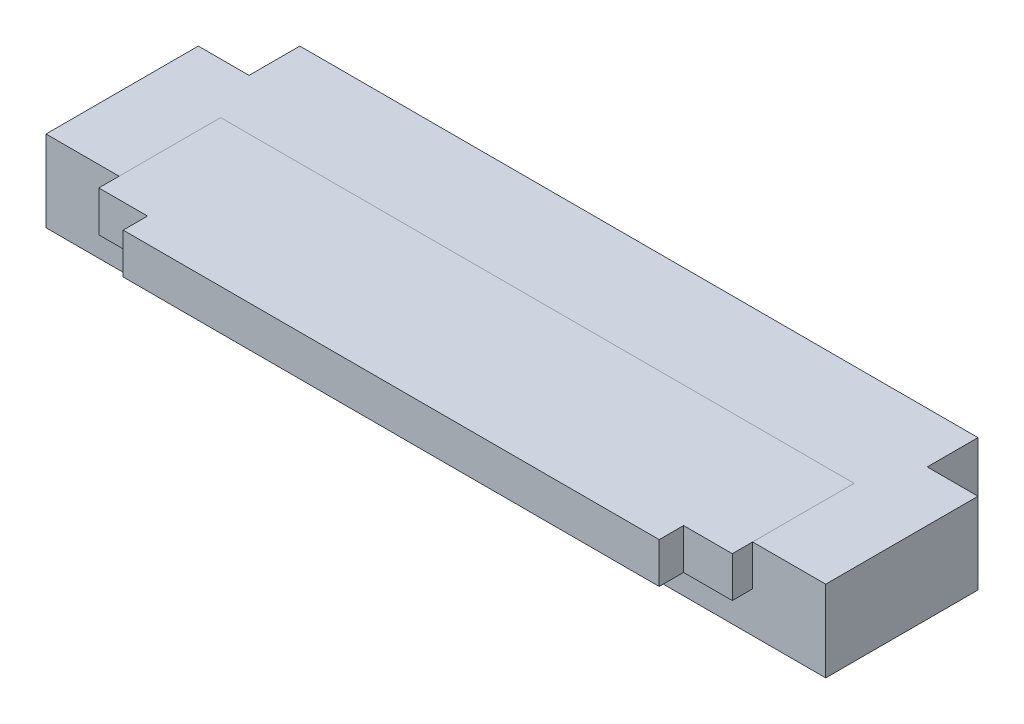
ISO-10303-21;
HEADER;
FILE_DESCRIPTION(('STEP AP214'),'2;1');
FILE_NAME('part.step','',(''),(''),'','','');
FILE_SCHEMA(('AUTOMOTIVE_DESIGN { 1 0 10303 214 1 1 1 1 }'));
ENDSEC;
DATA;
#1=APPLICATION_CONTEXT('core data for automotive mechanical design processes');
#2=APPLICATION_PROTOCOL_DEFINITION('international standard','automotive_design',2000,#1);
#3=PRODUCT_CONTEXT('',#1,'mechanical');
#4=PRODUCT('Part','Part','',(#3));
#5=PRODUCT_RELATED_PRODUCT_CATEGORY('part','',(#4));
#6=PRODUCT_DEFINITION_FORMATION('','',#4);
#7=PRODUCT_DEFINITION_CONTEXT('part definition',#1,'design');
#8=PRODUCT_DEFINITION('design','',#6,#7);
#9=PRODUCT_DEFINITION_SHAPE('','',#8);
#10=(LENGTH_UNIT() NAMED_UNIT(*) SI_UNIT(.MILLI.,.METRE.));
#11=(NAMED_UNIT(*) PLANE_ANGLE_UNIT() SI_UNIT($,.RADIAN.));
#12=(NAMED_UNIT(*) SI_UNIT($,.STERADIAN.) SOLID_ANGLE_UNIT());
#13=UNCERTAINTY_MEASURE_WITH_UNIT(LENGTH_MEASURE(1.E-05),#10,'distance_accuracy_value','');
#14=(GEOMETRIC_REPRESENTATION_CONTEXT(3) GLOBAL_UNCERTAINTY_ASSIGNED_CONTEXT((#13)) GLOBAL_UNIT_ASSIGNED_CONTEXT((#10,
#11,#12)) REPRESENTATION_CONTEXT('',''));
#15=CARTESIAN_POINT('',(0.,0.,0.));
#16=DIRECTION('',(0.,0.,1.));
#17=DIRECTION('',(1.,0.,0.));
#18=AXIS2_PLACEMENT_3D('',#15,#16,#17);
#19=CARTESIAN_POINT('',(-3.9,1.,1.5));
#20=DIRECTION('',(0.,1.,0.));
#21=DIRECTION('',(0.,0.,1.));
#22=AXIS2_PLACEMENT_3D('',#19,#20,#21);
#23=PLANE('',#22);
#24=DIRECTION('',(0.,0.,-1.));
#25=VECTOR('',#24,1.);
#26=CARTESIAN_POINT('',(3.9,1.,0.));
#27=LINE('',#26,#25);
#28=CARTESIAN_POINT('',(3.9,1.,0.));
#29=VERTEX_POINT('',#28);
#30=CARTESIAN_POINT('',(3.9,1.,1.5));
#31=VERTEX_POINT('',#30);
#32=EDGE_CURVE('P0_E115',#29,#31,#27,.F.);
#33=ORIENTED_EDGE('',*,*,#32,.F.);
#34=DIRECTION('',(-1.,0.,0.));
#35=VECTOR('',#34,1.);
#36=CARTESIAN_POINT('',(-3.9,1.,0.));
#37=LINE('',#36,#35);
#38=CARTESIAN_POINT('',(-3.9,1.,0.));
#39=VERTEX_POINT('',#38);
#40=EDGE_CURVE('P0_E119',#39,#29,#37,.F.);
#41=ORIENTED_EDGE('',*,*,#40,.F.);
#42=DIRECTION('',(0.,0.,1.));
#43=VECTOR('',#42,1.);
#44=CARTESIAN_POINT('',(-3.9,1.,1.5));
#45=LINE('',#44,#43);
#46=CARTESIAN_POINT('',(-3.9,1.,1.5));
#47=VERTEX_POINT('',#46);
#48=EDGE_CURVE('P0_E20',#39,#47,#45,.T.);
#49=ORIENTED_EDGE('',*,*,#48,.T.);
#50=DIRECTION('',(1.,0.,0.));
#51=VECTOR('',#50,1.);
#52=CARTESIAN_POINT('',(-3.9,1.,1.5));
#53=LINE('',#52,#51);
#54=CARTESIAN_POINT('',(-3.3,1.,1.5));
#55=VERTEX_POINT('',#54);
#56=EDGE_CURVE('P0_E92',#55,#47,#53,.F.);
#57=ORIENTED_EDGE('',*,*,#56,.F.);
#58=DIRECTION('',(0.,0.,1.));
#59=VECTOR('',#58,1.);
#60=CARTESIAN_POINT('',(-3.3,1.,1.5));
#61=LINE('',#60,#59);
#62=CARTESIAN_POINT('',(-3.3,1.,1.8));
#63=VERTEX_POINT('',#62);
#64=EDGE_CURVE('P0_E83',#63,#55,#61,.F.);
#65=ORIENTED_EDGE('',*,*,#64,.F.);
#66=DIRECTION('',(1.,0.,0.));
#67=VECTOR('',#66,1.);
#68=CARTESIAN_POINT('',(-3.3,1.,1.8));
#69=LINE('',#68,#67);
#70=CARTESIAN_POINT('',(3.3,1.,1.8));
#71=VERTEX_POINT('',#70);
#72=EDGE_CURVE('P0_E78',#71,#63,#69,.F.);
#73=ORIENTED_EDGE('',*,*,#72,.F.);
#74=DIRECTION('',(0.,0.,-1.));
#75=VECTOR('',#74,1.);
#76=CARTESIAN_POINT('',(3.3,1.,1.8));
#77=LINE('',#76,#75);
#78=CARTESIAN_POINT('',(3.3,1.,1.5));
#79=VERTEX_POINT('',#78);
#80=EDGE_CURVE('P0_E107',#79,#71,#77,.F.);
#81=ORIENTED_EDGE('',*,*,#80,.F.);
#82=DIRECTION('',(1.,0.,0.));
#83=VECTOR('',#82,1.);
#84=CARTESIAN_POINT('',(3.3,1.,1.5));
#85=LINE('',#84,#83);
#86=EDGE_CURVE('P0_E111',#31,#79,#85,.F.);
#87=ORIENTED_EDGE('',*,*,#86,.F.);
#88=EDGE_LOOP('',(#33,#41,#49,#57,#65,#73,#81,#87));
#89=FACE_BOUND('',#88,.T.);
#90=ADVANCED_FACE('P0_F17',(#89),#23,.T.);
#91=CARTESIAN_POINT('',(-3.9,0.5,1.5));
#92=DIRECTION('',(0.,0.,1.));
#93=DIRECTION('',(1.,0.,0.));
#94=AXIS2_PLACEMENT_3D('',#91,#92,#93);
#95=PLANE('',#94);
#96=DIRECTION('',(1.,0.,0.));
#97=VECTOR('',#96,1.);
#98=CARTESIAN_POINT('',(-3.9,0.5,1.5));
#99=LINE('',#98,#97);
#100=CARTESIAN_POINT('',(-3.9,0.5,1.5));
#101=VERTEX_POINT('',#100);
#102=CARTESIAN_POINT('',(-3.3,0.5,1.5));
#103=VERTEX_POINT('',#102);
#104=EDGE_CURVE('P0_E102',#101,#103,#99,.T.);
#105=ORIENTED_EDGE('',*,*,#104,.T.);
#106=DIRECTION('',(0.,1.,0.));
#107=VECTOR('',#106,1.);
#108=CARTESIAN_POINT('',(-3.3,0.5,1.5));
#109=LINE('',#108,#107);
#110=EDGE_CURVE('P0_E88',#55,#103,#109,.F.);
#111=ORIENTED_EDGE('',*,*,#110,.F.);
#112=ORIENTED_EDGE('',*,*,#56,.T.);
#113=DIRECTION('',(0.,1.,0.));
#114=VECTOR('',#113,1.);
#115=CARTESIAN_POINT('',(-3.9,0.5,1.5));
#116=LINE('',#115,#114);
#117=EDGE_CURVE('P0_E124',#101,#47,#116,.T.);
#118=ORIENTED_EDGE('',*,*,#117,.F.);
#119=EDGE_LOOP('',(#105,#111,#112,#118));
#120=FACE_BOUND('',#119,.T.);
#121=ADVANCED_FACE('P0_F101',(#120),#95,.T.);
#122=CARTESIAN_POINT('',(-3.3,0.5,1.5));
#123=DIRECTION('',(-1.,0.,0.));
#124=DIRECTION('',(0.,0.,1.));
#125=AXIS2_PLACEMENT_3D('',#122,#123,#124);
#126=PLANE('',#125);
#127=DIRECTION('',(0.,0.,1.));
#128=VECTOR('',#127,1.);
#129=CARTESIAN_POINT('',(-3.3,0.5,1.5));
#130=LINE('',#129,#128);
#131=CARTESIAN_POINT('',(-3.3,0.5,1.8));
#132=VERTEX_POINT('',#131);
#133=EDGE_CURVE('P0_E127',#103,#132,#130,.T.);
#134=ORIENTED_EDGE('',*,*,#133,.T.);
#135=DIRECTION('',(0.,1.,0.));
#136=VECTOR('',#135,1.);
#137=CARTESIAN_POINT('',(-3.3,0.5,1.8));
#138=LINE('',#137,#136);
#139=EDGE_CURVE('P0_E90',#63,#132,#138,.F.);
#140=ORIENTED_EDGE('',*,*,#139,.F.);
#141=ORIENTED_EDGE('',*,*,#64,.T.);
#142=ORIENTED_EDGE('',*,*,#110,.T.);
#143=EDGE_LOOP('',(#134,#140,#141,#142));
#144=FACE_BOUND('',#143,.T.);
#145=ADVANCED_FACE('P0_F86',(#144),#126,.T.);
#146=CARTESIAN_POINT('',(-3.3,0.5,1.8));
#147=DIRECTION('',(0.,0.,1.));
#148=DIRECTION('',(1.,0.,0.));
#149=AXIS2_PLACEMENT_3D('',#146,#147,#148);
#150=PLANE('',#149);
#151=DIRECTION('',(1.,0.,0.));
#152=VECTOR('',#151,1.);
#153=CARTESIAN_POINT('',(-3.9,0.5,1.8));
#154=LINE('',#153,#152);
#155=CARTESIAN_POINT('',(3.3,0.5,1.8));
#156=VERTEX_POINT('',#155);
#157=EDGE_CURVE('P0_E129',#132,#156,#154,.T.);
#158=ORIENTED_EDGE('',*,*,#157,.T.);
#159=DIRECTION('',(0.,1.,0.));
#160=VECTOR('',#159,1.);
#161=CARTESIAN_POINT('',(3.3,0.5,1.8));
#162=LINE('',#161,#160);
#163=EDGE_CURVE('P0_E109',#71,#156,#162,.F.);
#164=ORIENTED_EDGE('',*,*,#163,.F.);
#165=ORIENTED_EDGE('',*,*,#72,.T.);
#166=ORIENTED_EDGE('',*,*,#139,.T.);
#167=EDGE_LOOP('',(#158,#164,#165,#166));
#168=FACE_BOUND('',#167,.T.);
#169=ADVANCED_FACE('P0_F162',(#168),#150,.T.);
#170=CARTESIAN_POINT('',(3.3,0.5,1.8));
#171=DIRECTION('',(1.,0.,0.));
#172=DIRECTION('',(0.,0.,-1.));
#173=AXIS2_PLACEMENT_3D('',#170,#171,#172);
#174=PLANE('',#173);
#175=DIRECTION('',(0.,0.,1.));
#176=VECTOR('',#175,1.);
#177=CARTESIAN_POINT('',(3.3,0.5,1.5));
#178=LINE('',#177,#176);
#179=CARTESIAN_POINT('',(3.3,0.5,1.5));
#180=VERTEX_POINT('',#179);
#181=EDGE_CURVE('P0_E132',#156,#180,#178,.F.);
#182=ORIENTED_EDGE('',*,*,#181,.T.);
#183=DIRECTION('',(0.,1.,0.));
#184=VECTOR('',#183,1.);
#185=CARTESIAN_POINT('',(3.3,0.5,1.5));
#186=LINE('',#185,#184);
#187=EDGE_CURVE('P0_E113',#79,#180,#186,.F.);
#188=ORIENTED_EDGE('',*,*,#187,.F.);
#189=ORIENTED_EDGE('',*,*,#80,.T.);
#190=ORIENTED_EDGE('',*,*,#163,.T.);
#191=EDGE_LOOP('',(#182,#188,#189,#190));
#192=FACE_BOUND('',#191,.T.);
#193=ADVANCED_FACE('P0_F161',(#192),#174,.T.);
#194=CARTESIAN_POINT('',(3.3,0.5,1.5));
#195=DIRECTION('',(0.,0.,1.));
#196=DIRECTION('',(1.,0.,0.));
#197=AXIS2_PLACEMENT_3D('',#194,#195,#196);
#198=PLANE('',#197);
#199=DIRECTION('',(1.,0.,0.));
#200=VECTOR('',#199,1.);
#201=CARTESIAN_POINT('',(-3.9,0.5,1.5));
#202=LINE('',#201,#200);
#203=CARTESIAN_POINT('',(3.9,0.5,1.5));
#204=VERTEX_POINT('',#203);
#205=EDGE_CURVE('P0_E135',#180,#204,#202,.T.);
#206=ORIENTED_EDGE('',*,*,#205,.T.);
#207=DIRECTION('',(0.,1.,0.));
#208=VECTOR('',#207,1.);
#209=CARTESIAN_POINT('',(3.9,0.5,1.5));
#210=LINE('',#209,#208);
#211=EDGE_CURVE('P0_E117',#31,#204,#210,.F.);
#212=ORIENTED_EDGE('',*,*,#211,.F.);
#213=ORIENTED_EDGE('',*,*,#86,.T.);
#214=ORIENTED_EDGE('',*,*,#187,.T.);
#215=EDGE_LOOP('',(#206,#212,#213,#214));
#216=FACE_BOUND('',#215,.T.);
#217=ADVANCED_FACE('P0_F155',(#216),#198,.T.);
#218=CARTESIAN_POINT('',(3.9,0.5,0.));
#219=DIRECTION('',(1.,0.,0.));
#220=DIRECTION('',(0.,0.,-1.));
#221=AXIS2_PLACEMENT_3D('',#218,#219,#220);
#222=PLANE('',#221);
#223=DIRECTION('',(0.,0.,1.));
#224=VECTOR('',#223,1.);
#225=CARTESIAN_POINT('',(3.9,0.5,1.5));
#226=LINE('',#225,#224);
#227=CARTESIAN_POINT('',(3.9,0.5,0.));
#228=VERTEX_POINT('',#227);
#229=EDGE_CURVE('P0_E138',#204,#228,#226,.F.);
#230=ORIENTED_EDGE('',*,*,#229,.T.);
#231=DIRECTION('',(0.,1.,0.));
#232=VECTOR('',#231,1.);
#233=CARTESIAN_POINT('',(3.9,0.5,0.));
#234=LINE('',#233,#232);
#235=EDGE_CURVE('P0_E121',#29,#228,#234,.F.);
#236=ORIENTED_EDGE('',*,*,#235,.F.);
#237=ORIENTED_EDGE('',*,*,#32,.T.);
#238=ORIENTED_EDGE('',*,*,#211,.T.);
#239=EDGE_LOOP('',(#230,#236,#237,#238));
#240=FACE_BOUND('',#239,.T.);
#241=ADVANCED_FACE('P0_F151',(#240),#222,.T.);
#242=CARTESIAN_POINT('',(-3.9,0.5,0.));
#243=DIRECTION('',(0.,0.,-1.));
#244=DIRECTION('',(-1.,0.,0.));
#245=AXIS2_PLACEMENT_3D('',#242,#243,#244);
#246=PLANE('',#245);
#247=DIRECTION('',(1.,0.,0.));
#248=VECTOR('',#247,1.);
#249=CARTESIAN_POINT('',(-3.9,0.5,0.));
#250=LINE('',#249,#248);
#251=CARTESIAN_POINT('',(-3.9,0.5,0.));
#252=VERTEX_POINT('',#251);
#253=EDGE_CURVE('P0_E26',#228,#252,#250,.F.);
#254=ORIENTED_EDGE('',*,*,#253,.T.);
#255=DIRECTION('',(0.,1.,0.));
#256=VECTOR('',#255,1.);
#257=CARTESIAN_POINT('',(-3.9,0.5,0.));
#258=LINE('',#257,#256);
#259=EDGE_CURVE('P0_E34',#39,#252,#258,.F.);
#260=ORIENTED_EDGE('',*,*,#259,.F.);
#261=ORIENTED_EDGE('',*,*,#40,.T.);
#262=ORIENTED_EDGE('',*,*,#235,.T.);
#263=EDGE_LOOP('',(#254,#260,#261,#262));
#264=FACE_BOUND('',#263,.T.);
#265=ADVANCED_FACE('P0_F144',(#264),#246,.T.);
#266=CARTESIAN_POINT('',(-3.9,0.5,0.));
#267=DIRECTION('',(-1.,0.,0.));
#268=DIRECTION('',(0.,0.,1.));
#269=AXIS2_PLACEMENT_3D('',#266,#267,#268);
#270=PLANE('',#269);
#271=DIRECTION('',(0.,0.,1.));
#272=VECTOR('',#271,1.);
#273=CARTESIAN_POINT('',(-3.9,0.5,1.5));
#274=LINE('',#273,#272);
#275=EDGE_CURVE('P0_E11',#252,#101,#274,.T.);
#276=ORIENTED_EDGE('',*,*,#275,.T.);
#277=ORIENTED_EDGE('',*,*,#117,.T.);
#278=ORIENTED_EDGE('',*,*,#48,.F.);
#279=ORIENTED_EDGE('',*,*,#259,.T.);
#280=EDGE_LOOP('',(#276,#277,#278,#279));
#281=FACE_BOUND('',#280,.T.);
#282=ADVANCED_FACE('P0_F163',(#281),#270,.T.);
#283=CARTESIAN_POINT('',(-3.9,0.5,1.5));
#284=DIRECTION('',(0.,1.,0.));
#285=DIRECTION('',(0.,0.,1.));
#286=AXIS2_PLACEMENT_3D('',#283,#284,#285);
#287=PLANE('',#286);
#288=ORIENTED_EDGE('',*,*,#253,.F.);
#289=ORIENTED_EDGE('',*,*,#229,.F.);
#290=ORIENTED_EDGE('',*,*,#205,.F.);
#291=ORIENTED_EDGE('',*,*,#181,.F.);
#292=ORIENTED_EDGE('',*,*,#157,.F.);
#293=ORIENTED_EDGE('',*,*,#133,.F.);
#294=ORIENTED_EDGE('',*,*,#104,.F.);
#295=ORIENTED_EDGE('',*,*,#275,.F.);
#296=EDGE_LOOP('',(#288,#289,#290,#291,#292,#293,#294,#295));
#297=FACE_BOUND('',#296,.T.);
#298=ADVANCED_FACE('P0_F148',(#297),#287,.F.);
#299=CLOSED_SHELL('',(#90,#121,#145,#169,#193,#217,#241,#265,#282,#298));
#300=MANIFOLD_SOLID_BREP('P0_B1',#299);
#301=CARTESIAN_POINT('',(-3.9,-8.0049984384758,0.));
#302=DIRECTION('',(0.,0.,-1.));
#303=DIRECTION('',(-1.,0.,0.));
#304=AXIS2_PLACEMENT_3D('',#301,#302,#303);
#305=PLANE('',#304);
#306=DIRECTION('',(0.,1.,0.));
#307=VECTOR('',#306,1.);
#308=CARTESIAN_POINT('',(3.9,-8.0049984384758,0.));
#309=LINE('',#308,#307);
#310=CARTESIAN_POINT('',(3.9,0.5,0.));
#311=VERTEX_POINT('',#310);
#312=CARTESIAN_POINT('',(3.9,1.,0.));
#313=VERTEX_POINT('',#312);
#314=EDGE_CURVE('P1_E19',#311,#313,#309,.T.);
#315=ORIENTED_EDGE('',*,*,#314,.T.);
#316=DIRECTION('',(1.,0.,0.));
#317=VECTOR('',#316,1.);
#318=CARTESIAN_POINT('',(-4.8,1.,0.));
#319=LINE('',#318,#317);
#320=CARTESIAN_POINT('',(-3.9,1.,0.));
#321=VERTEX_POINT('',#320);
#322=EDGE_CURVE('P1_E129',#321,#313,#319,.T.);
#323=ORIENTED_EDGE('',*,*,#322,.F.);
#324=DIRECTION('',(0.,1.,0.));
#325=VECTOR('',#324,1.);
#326=CARTESIAN_POINT('',(-3.9,-8.0049984384758,0.));
#327=LINE('',#326,#325);
#328=CARTESIAN_POINT('',(-3.9,0.5,0.));
#329=VERTEX_POINT('',#328);
#330=EDGE_CURVE('P1_E116',#321,#329,#327,.F.);
#331=ORIENTED_EDGE('',*,*,#330,.T.);
#332=DIRECTION('',(1.,0.,0.));
#333=VECTOR('',#332,1.);
#334=CARTESIAN_POINT('',(-4.8,0.5,0.));
#335=LINE('',#334,#333);
#336=EDGE_CURVE('P1_E102',#311,#329,#335,.F.);
#337=ORIENTED_EDGE('',*,*,#336,.F.);
#338=EDGE_LOOP('',(#315,#323,#331,#337));
#339=FACE_BOUND('',#338,.T.);
#340=ADVANCED_FACE('P1_F16',(#339),#305,.F.);
#341=CARTESIAN_POINT('',(3.9,-8.0049984384758,0.));
#342=DIRECTION('',(1.,0.,0.));
#343=DIRECTION('',(0.,0.,-1.));
#344=AXIS2_PLACEMENT_3D('',#341,#342,#343);
#345=PLANE('',#344);
#346=ORIENTED_EDGE('',*,*,#314,.F.);
#347=DIRECTION('',(0.,0.,1.));
#348=VECTOR('',#347,1.);
#349=CARTESIAN_POINT('',(3.9,0.5,-0.625));
#350=LINE('',#349,#348);
#351=CARTESIAN_POINT('',(3.9,0.5,1.25));
#352=VERTEX_POINT('',#351);
#353=EDGE_CURVE('P1_E111',#352,#311,#350,.F.);
#354=ORIENTED_EDGE('',*,*,#353,.F.);
#355=DIRECTION('',(0.,1.,0.));
#356=VECTOR('',#355,1.);
#357=CARTESIAN_POINT('',(3.9,1.,1.25));
#358=LINE('',#357,#356);
#359=CARTESIAN_POINT('',(3.9,1.,1.25));
#360=VERTEX_POINT('',#359);
#361=EDGE_CURVE('P1_E132',#352,#360,#358,.T.);
#362=ORIENTED_EDGE('',*,*,#361,.T.);
#363=DIRECTION('',(0.,0.,1.));
#364=VECTOR('',#363,1.);
#365=CARTESIAN_POINT('',(3.9,1.,-0.625));
#366=LINE('',#365,#364);
#367=EDGE_CURVE('P1_E113',#313,#360,#366,.T.);
#368=ORIENTED_EDGE('',*,*,#367,.F.);
#369=EDGE_LOOP('',(#346,#354,#362,#368));
#370=FACE_BOUND('',#369,.T.);
#371=ADVANCED_FACE('P1_F109',(#370),#345,.F.);
#372=CARTESIAN_POINT('',(-3.9,-8.0049984384758,0.));
#373=DIRECTION('',(-1.,0.,0.));
#374=DIRECTION('',(0.,0.,1.));
#375=AXIS2_PLACEMENT_3D('',#372,#373,#374);
#376=PLANE('',#375);
#377=ORIENTED_EDGE('',*,*,#330,.F.);
#378=DIRECTION('',(0.,0.,1.));
#379=VECTOR('',#378,1.);
#380=CARTESIAN_POINT('',(-3.9,1.,-0.625));
#381=LINE('',#380,#379);
#382=CARTESIAN_POINT('',(-3.9,1.,1.25));
#383=VERTEX_POINT('',#382);
#384=EDGE_CURVE('P1_E124',#383,#321,#381,.F.);
#385=ORIENTED_EDGE('',*,*,#384,.F.);
#386=DIRECTION('',(0.,1.,0.));
#387=VECTOR('',#386,1.);
#388=CARTESIAN_POINT('',(-3.9,1.,1.25));
#389=LINE('',#388,#387);
#390=CARTESIAN_POINT('',(-3.9,0.5,1.25));
#391=VERTEX_POINT('',#390);
#392=EDGE_CURVE('P1_E139',#383,#391,#389,.F.);
#393=ORIENTED_EDGE('',*,*,#392,.T.);
#394=DIRECTION('',(0.,0.,1.));
#395=VECTOR('',#394,1.);
#396=CARTESIAN_POINT('',(-3.9,0.5,-0.625));
#397=LINE('',#396,#395);
#398=EDGE_CURVE('P1_E122',#329,#391,#397,.T.);
#399=ORIENTED_EDGE('',*,*,#398,.F.);
#400=EDGE_LOOP('',(#377,#385,#393,#399));
#401=FACE_BOUND('',#400,.T.);
#402=ADVANCED_FACE('P1_F259',(#401),#376,.F.);
#403=CARTESIAN_POINT('',(-4.8,0.5,-0.625));
#404=DIRECTION('',(0.,1.,0.));
#405=DIRECTION('',(0.,0.,1.));
#406=AXIS2_PLACEMENT_3D('',#403,#404,#405);
#407=PLANE('',#406);
#408=ORIENTED_EDGE('',*,*,#336,.T.);
#409=ORIENTED_EDGE('',*,*,#398,.T.);
#410=DIRECTION('',(-1.,0.,0.));
#411=VECTOR('',#410,1.);
#412=CARTESIAN_POINT('',(-4.8,0.5,1.25));
#413=LINE('',#412,#411);
#414=EDGE_CURVE('P1_E119',#391,#352,#413,.F.);
#415=ORIENTED_EDGE('',*,*,#414,.T.);
#416=ORIENTED_EDGE('',*,*,#353,.T.);
#417=EDGE_LOOP('',(#408,#409,#415,#416));
#418=FACE_BOUND('',#417,.T.);
#419=ADVANCED_FACE('P1_F117',(#418),#407,.T.);
#420=CARTESIAN_POINT('',(-4.8,1.,-0.625));
#421=DIRECTION('',(0.,1.,0.));
#422=DIRECTION('',(0.,0.,1.));
#423=AXIS2_PLACEMENT_3D('',#420,#421,#422);
#424=PLANE('',#423);
#425=DIRECTION('',(0.,0.,-1.));
#426=VECTOR('',#425,1.);
#427=CARTESIAN_POINT('',(-4.8,1.,1.25));
#428=LINE('',#427,#426);
#429=CARTESIAN_POINT('',(-4.8,1.,-0.625));
#430=VERTEX_POINT('',#429);
#431=CARTESIAN_POINT('',(-4.8,1.,1.25));
#432=VERTEX_POINT('',#431);
#433=EDGE_CURVE('P1_E174',#430,#432,#428,.F.);
#434=ORIENTED_EDGE('',*,*,#433,.T.);
#435=DIRECTION('',(-1.,0.,0.));
#436=VECTOR('',#435,1.);
#437=CARTESIAN_POINT('',(-4.8,1.,1.25));
#438=LINE('',#437,#436);
#439=EDGE_CURVE('P1_E136',#432,#383,#438,.F.);
#440=ORIENTED_EDGE('',*,*,#439,.T.);
#441=ORIENTED_EDGE('',*,*,#384,.T.);
#442=ORIENTED_EDGE('',*,*,#322,.T.);
#443=ORIENTED_EDGE('',*,*,#367,.T.);
#444=DIRECTION('',(-1.,0.,0.));
#445=VECTOR('',#444,1.);
#446=CARTESIAN_POINT('',(-4.8,1.,1.25));
#447=LINE('',#446,#445);
#448=CARTESIAN_POINT('',(4.8,1.,1.25));
#449=VERTEX_POINT('',#448);
#450=EDGE_CURVE('P1_E134',#360,#449,#447,.F.);
#451=ORIENTED_EDGE('',*,*,#450,.T.);
#452=DIRECTION('',(0.,0.,1.));
#453=VECTOR('',#452,1.);
#454=CARTESIAN_POINT('',(4.8,1.,0.));
#455=LINE('',#454,#453);
#456=CARTESIAN_POINT('',(4.8,1.,-0.625));
#457=VERTEX_POINT('',#456);
#458=EDGE_CURVE('P1_E146',#449,#457,#455,.F.);
#459=ORIENTED_EDGE('',*,*,#458,.T.);
#460=DIRECTION('',(1.,0.,0.));
#461=VECTOR('',#460,1.);
#462=CARTESIAN_POINT('',(4.175,1.,-0.625));
#463=LINE('',#462,#461);
#464=CARTESIAN_POINT('',(4.175,1.,-0.625));
#465=VERTEX_POINT('',#464);
#466=EDGE_CURVE('P1_E151',#457,#465,#463,.F.);
#467=ORIENTED_EDGE('',*,*,#466,.T.);
#468=DIRECTION('',(0.,0.,1.));
#469=VECTOR('',#468,1.);
#470=CARTESIAN_POINT('',(4.175,1.,-1.25));
#471=LINE('',#470,#469);
#472=CARTESIAN_POINT('',(4.175,1.,-1.25));
#473=VERTEX_POINT('',#472);
#474=EDGE_CURVE('P1_E156',#465,#473,#471,.F.);
#475=ORIENTED_EDGE('',*,*,#474,.T.);
#476=DIRECTION('',(1.,0.,0.));
#477=VECTOR('',#476,1.);
#478=CARTESIAN_POINT('',(-4.175,1.,-1.25));
#479=LINE('',#478,#477);
#480=CARTESIAN_POINT('',(-4.175,1.,-1.25));
#481=VERTEX_POINT('',#480);
#482=EDGE_CURVE('P1_E161',#473,#481,#479,.F.);
#483=ORIENTED_EDGE('',*,*,#482,.T.);
#484=DIRECTION('',(0.,0.,-1.));
#485=VECTOR('',#484,1.);
#486=CARTESIAN_POINT('',(-4.175,1.,-1.25));
#487=LINE('',#486,#485);
#488=CARTESIAN_POINT('',(-4.175,1.,-0.625));
#489=VERTEX_POINT('',#488);
#490=EDGE_CURVE('P1_E166',#481,#489,#487,.F.);
#491=ORIENTED_EDGE('',*,*,#490,.T.);
#492=DIRECTION('',(1.,0.,0.));
#493=VECTOR('',#492,1.);
#494=CARTESIAN_POINT('',(-4.175,1.,-0.625));
#495=LINE('',#494,#493);
#496=EDGE_CURVE('P1_E171',#489,#430,#495,.F.);
#497=ORIENTED_EDGE('',*,*,#496,.T.);
#498=EDGE_LOOP('',(#434,#440,#441,#442,#443,#451,#459,#467,#475,#483,#491,#497));
#499=FACE_BOUND('',#498,.T.);
#500=ADVANCED_FACE('P1_F253',(#499),#424,.T.);
#501=CARTESIAN_POINT('',(-4.8,1.,1.25));
#502=DIRECTION('',(0.,0.,-1.));
#503=DIRECTION('',(-1.,0.,0.));
#504=AXIS2_PLACEMENT_3D('',#501,#502,#503);
#505=PLANE('',#504);
#506=ORIENTED_EDGE('',*,*,#392,.F.);
#507=ORIENTED_EDGE('',*,*,#439,.F.);
#508=DIRECTION('',(0.,1.,0.));
#509=VECTOR('',#508,1.);
#510=CARTESIAN_POINT('',(-4.8,1.,1.25));
#511=LINE('',#510,#509);
#512=CARTESIAN_POINT('',(-4.8,0.,1.25));
#513=VERTEX_POINT('',#512);
#514=EDGE_CURVE('P1_E177',#432,#513,#511,.F.);
#515=ORIENTED_EDGE('',*,*,#514,.T.);
#516=DIRECTION('',(1.,0.,0.));
#517=VECTOR('',#516,1.);
#518=CARTESIAN_POINT('',(-4.8,0.,1.25));
#519=LINE('',#518,#517);
#520=CARTESIAN_POINT('',(4.8,0.,1.25));
#521=VERTEX_POINT('',#520);
#522=EDGE_CURVE('P1_E180',#513,#521,#519,.T.);
#523=ORIENTED_EDGE('',*,*,#522,.T.);
#524=DIRECTION('',(0.,1.,0.));
#525=VECTOR('',#524,1.);
#526=CARTESIAN_POINT('',(4.8,1.,1.25));
#527=LINE('',#526,#525);
#528=EDGE_CURVE('P1_E143',#521,#449,#527,.T.);
#529=ORIENTED_EDGE('',*,*,#528,.T.);
#530=ORIENTED_EDGE('',*,*,#450,.F.);
#531=ORIENTED_EDGE('',*,*,#361,.F.);
#532=ORIENTED_EDGE('',*,*,#414,.F.);
#533=EDGE_LOOP('',(#506,#507,#515,#523,#529,#530,#531,#532));
#534=FACE_BOUND('',#533,.T.);
#535=ADVANCED_FACE('P1_F228',(#534),#505,.F.);
#536=CARTESIAN_POINT('',(4.8,1.,0.));
#537=DIRECTION('',(-1.,0.,0.));
#538=DIRECTION('',(0.,0.,1.));
#539=AXIS2_PLACEMENT_3D('',#536,#537,#538);
#540=PLANE('',#539);
#541=DIRECTION('',(0.,1.,0.));
#542=VECTOR('',#541,1.);
#543=CARTESIAN_POINT('',(4.8,1.,-0.625));
#544=LINE('',#543,#542);
#545=CARTESIAN_POINT('',(4.8,0.,-0.625));
#546=VERTEX_POINT('',#545);
#547=EDGE_CURVE('P1_E148',#546,#457,#544,.T.);
#548=ORIENTED_EDGE('',*,*,#547,.T.);
#549=ORIENTED_EDGE('',*,*,#458,.F.);
#550=ORIENTED_EDGE('',*,*,#528,.F.);
#551=DIRECTION('',(0.,0.,1.));
#552=VECTOR('',#551,1.);
#553=CARTESIAN_POINT('',(4.8,0.,-0.625));
#554=LINE('',#553,#552);
#555=EDGE_CURVE('P1_E183',#521,#546,#554,.F.);
#556=ORIENTED_EDGE('',*,*,#555,.T.);
#557=EDGE_LOOP('',(#548,#549,#550,#556));
#558=FACE_BOUND('',#557,.T.);
#559=ADVANCED_FACE('P1_F223',(#558),#540,.F.);
#560=CARTESIAN_POINT('',(4.175,1.,-0.625));
#561=DIRECTION('',(0.,0.,1.));
#562=DIRECTION('',(1.,0.,0.));
#563=AXIS2_PLACEMENT_3D('',#560,#561,#562);
#564=PLANE('',#563);
#565=DIRECTION('',(0.,1.,0.));
#566=VECTOR('',#565,1.);
#567=CARTESIAN_POINT('',(4.175,1.,-0.625));
#568=LINE('',#567,#566);
#569=CARTESIAN_POINT('',(4.175,0.,-0.625));
#570=VERTEX_POINT('',#569);
#571=EDGE_CURVE('P1_E153',#570,#465,#568,.T.);
#572=ORIENTED_EDGE('',*,*,#571,.T.);
#573=ORIENTED_EDGE('',*,*,#466,.F.);
#574=ORIENTED_EDGE('',*,*,#547,.F.);
#575=DIRECTION('',(1.,0.,0.));
#576=VECTOR('',#575,1.);
#577=CARTESIAN_POINT('',(-4.8,0.,-0.625));
#578=LINE('',#577,#576);
#579=EDGE_CURVE('P1_E186',#546,#570,#578,.F.);
#580=ORIENTED_EDGE('',*,*,#579,.T.);
#581=EDGE_LOOP('',(#572,#573,#574,#580));
#582=FACE_BOUND('',#581,.T.);
#583=ADVANCED_FACE('P1_F220',(#582),#564,.F.);
#584=CARTESIAN_POINT('',(4.175,1.,-1.25));
#585=DIRECTION('',(-1.,0.,0.));
#586=DIRECTION('',(0.,0.,1.));
#587=AXIS2_PLACEMENT_3D('',#584,#585,#586);
#588=PLANE('',#587);
#589=DIRECTION('',(0.,1.,0.));
#590=VECTOR('',#589,1.);
#591=CARTESIAN_POINT('',(4.175,1.,-1.25));
#592=LINE('',#591,#590);
#593=CARTESIAN_POINT('',(4.175,0.,-1.25));
#594=VERTEX_POINT('',#593);
#595=EDGE_CURVE('P1_E158',#594,#473,#592,.T.);
#596=ORIENTED_EDGE('',*,*,#595,.T.);
#597=ORIENTED_EDGE('',*,*,#474,.F.);
#598=ORIENTED_EDGE('',*,*,#571,.F.);
#599=DIRECTION('',(0.,0.,1.));
#600=VECTOR('',#599,1.);
#601=CARTESIAN_POINT('',(4.175,0.,-0.625));
#602=LINE('',#601,#600);
#603=EDGE_CURVE('P1_E189',#570,#594,#602,.F.);
#604=ORIENTED_EDGE('',*,*,#603,.T.);
#605=EDGE_LOOP('',(#596,#597,#598,#604));
#606=FACE_BOUND('',#605,.T.);
#607=ADVANCED_FACE('P1_F216',(#606),#588,.F.);
#608=CARTESIAN_POINT('',(-4.175,1.,-1.25));
#609=DIRECTION('',(0.,0.,1.));
#610=DIRECTION('',(1.,0.,0.));
#611=AXIS2_PLACEMENT_3D('',#608,#609,#610);
#612=PLANE('',#611);
#613=DIRECTION('',(0.,1.,0.));
#614=VECTOR('',#613,1.);
#615=CARTESIAN_POINT('',(-4.175,1.,-1.25));
#616=LINE('',#615,#614);
#617=CARTESIAN_POINT('',(-4.175,0.,-1.25));
#618=VERTEX_POINT('',#617);
#619=EDGE_CURVE('P1_E163',#618,#481,#616,.T.);
#620=ORIENTED_EDGE('',*,*,#619,.T.);
#621=ORIENTED_EDGE('',*,*,#482,.F.);
#622=ORIENTED_EDGE('',*,*,#595,.F.);
#623=DIRECTION('',(1.,0.,0.));
#624=VECTOR('',#623,1.);
#625=CARTESIAN_POINT('',(-4.8,0.,-1.25));
#626=LINE('',#625,#624);
#627=EDGE_CURVE('P1_E192',#594,#618,#626,.F.);
#628=ORIENTED_EDGE('',*,*,#627,.T.);
#629=EDGE_LOOP('',(#620,#621,#622,#628));
#630=FACE_BOUND('',#629,.T.);
#631=ADVANCED_FACE('P1_F212',(#630),#612,.F.);
#632=CARTESIAN_POINT('',(-4.175,1.,-1.25));
#633=DIRECTION('',(1.,0.,0.));
#634=DIRECTION('',(0.,0.,-1.));
#635=AXIS2_PLACEMENT_3D('',#632,#633,#634);
#636=PLANE('',#635);
#637=DIRECTION('',(0.,1.,0.));
#638=VECTOR('',#637,1.);
#639=CARTESIAN_POINT('',(-4.175,1.,-0.625));
#640=LINE('',#639,#638);
#641=CARTESIAN_POINT('',(-4.175,0.,-0.625));
#642=VERTEX_POINT('',#641);
#643=EDGE_CURVE('P1_E168',#642,#489,#640,.T.);
#644=ORIENTED_EDGE('',*,*,#643,.T.);
#645=ORIENTED_EDGE('',*,*,#490,.F.);
#646=ORIENTED_EDGE('',*,*,#619,.F.);
#647=DIRECTION('',(0.,0.,1.));
#648=VECTOR('',#647,1.);
#649=CARTESIAN_POINT('',(-4.175,0.,-0.625));
#650=LINE('',#649,#648);
#651=EDGE_CURVE('P1_E195',#618,#642,#650,.T.);
#652=ORIENTED_EDGE('',*,*,#651,.T.);
#653=EDGE_LOOP('',(#644,#645,#646,#652));
#654=FACE_BOUND('',#653,.T.);
#655=ADVANCED_FACE('P1_F208',(#654),#636,.F.);
#656=CARTESIAN_POINT('',(-4.175,1.,-0.625));
#657=DIRECTION('',(0.,0.,1.));
#658=DIRECTION('',(1.,0.,0.));
#659=AXIS2_PLACEMENT_3D('',#656,#657,#658);
#660=PLANE('',#659);
#661=DIRECTION('',(0.,1.,0.));
#662=VECTOR('',#661,1.);
#663=CARTESIAN_POINT('',(-4.8,1.,-0.625));
#664=LINE('',#663,#662);
#665=CARTESIAN_POINT('',(-4.8,0.,-0.625));
#666=VERTEX_POINT('',#665);
#667=EDGE_CURVE('P1_E33',#666,#430,#664,.T.);
#668=ORIENTED_EDGE('',*,*,#667,.T.);
#669=ORIENTED_EDGE('',*,*,#496,.F.);
#670=ORIENTED_EDGE('',*,*,#643,.F.);
#671=DIRECTION('',(1.,0.,0.));
#672=VECTOR('',#671,1.);
#673=CARTESIAN_POINT('',(-4.8,0.,-0.625));
#674=LINE('',#673,#672);
#675=EDGE_CURVE('P1_E25',#642,#666,#674,.F.);
#676=ORIENTED_EDGE('',*,*,#675,.T.);
#677=EDGE_LOOP('',(#668,#669,#670,#676));
#678=FACE_BOUND('',#677,.T.);
#679=ADVANCED_FACE('P1_F201',(#678),#660,.F.);
#680=CARTESIAN_POINT('',(-4.8,1.,1.25));
#681=DIRECTION('',(1.,0.,0.));
#682=DIRECTION('',(0.,0.,-1.));
#683=AXIS2_PLACEMENT_3D('',#680,#681,#682);
#684=PLANE('',#683);
#685=ORIENTED_EDGE('',*,*,#514,.F.);
#686=ORIENTED_EDGE('',*,*,#433,.F.);
#687=ORIENTED_EDGE('',*,*,#667,.F.);
#688=DIRECTION('',(0.,0.,1.));
#689=VECTOR('',#688,1.);
#690=CARTESIAN_POINT('',(-4.8,0.,-0.625));
#691=LINE('',#690,#689);
#692=EDGE_CURVE('P1_E10',#666,#513,#691,.T.);
#693=ORIENTED_EDGE('',*,*,#692,.T.);
#694=EDGE_LOOP('',(#685,#686,#687,#693));
#695=FACE_BOUND('',#694,.T.);
#696=ADVANCED_FACE('P1_F230',(#695),#684,.F.);
#697=CARTESIAN_POINT('',(-4.8,0.,-0.625));
#698=DIRECTION('',(0.,1.,0.));
#699=DIRECTION('',(0.,0.,1.));
#700=AXIS2_PLACEMENT_3D('',#697,#698,#699);
#701=PLANE('',#700);
#702=ORIENTED_EDGE('',*,*,#675,.F.);
#703=ORIENTED_EDGE('',*,*,#651,.F.);
#704=ORIENTED_EDGE('',*,*,#627,.F.);
#705=ORIENTED_EDGE('',*,*,#603,.F.);
#706=ORIENTED_EDGE('',*,*,#579,.F.);
#707=ORIENTED_EDGE('',*,*,#555,.F.);
#708=ORIENTED_EDGE('',*,*,#522,.F.);
#709=ORIENTED_EDGE('',*,*,#692,.F.);
#710=EDGE_LOOP('',(#702,#703,#704,#705,#706,#707,#708,#709));
#711=FACE_BOUND('',#710,.T.);
#712=ADVANCED_FACE('P1_F205',(#711),#701,.F.);
#713=CLOSED_SHELL('',(#340,#371,#402,#419,#500,#535,#559,#583,#607,#631,#655,#679,#696,#712));
#714=MANIFOLD_SOLID_BREP('P1_B1',#713);
#715=ADVANCED_BREP_SHAPE_REPRESENTATION('',(#18,#300,#714),#14);
#716=SHAPE_DEFINITION_REPRESENTATION(#9,#715);
ENDSEC;
END-ISO-10303-21;
